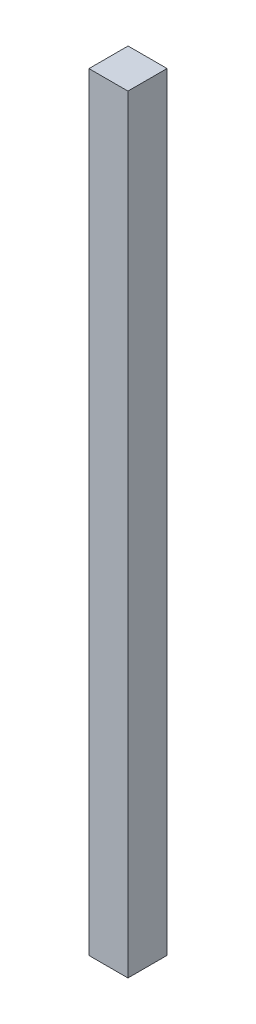
ISO-10303-21;
HEADER;
FILE_DESCRIPTION(('STEP AP214'),'2;1');
FILE_NAME('part.step','',(''),(''),'','','');
FILE_SCHEMA(('AUTOMOTIVE_DESIGN { 1 0 10303 214 1 1 1 1 }'));
ENDSEC;
DATA;
#1=APPLICATION_CONTEXT('core data for automotive mechanical design processes');
#2=APPLICATION_PROTOCOL_DEFINITION('international standard','automotive_design',2000,#1);
#3=PRODUCT_CONTEXT('',#1,'mechanical');
#4=PRODUCT('Part','Part','',(#3));
#5=PRODUCT_RELATED_PRODUCT_CATEGORY('part','',(#4));
#6=PRODUCT_DEFINITION_FORMATION('','',#4);
#7=PRODUCT_DEFINITION_CONTEXT('part definition',#1,'design');
#8=PRODUCT_DEFINITION('design','',#6,#7);
#9=PRODUCT_DEFINITION_SHAPE('','',#8);
#10=(LENGTH_UNIT() NAMED_UNIT(*) SI_UNIT(.MILLI.,.METRE.));
#11=(NAMED_UNIT(*) PLANE_ANGLE_UNIT() SI_UNIT($,.RADIAN.));
#12=(NAMED_UNIT(*) SI_UNIT($,.STERADIAN.) SOLID_ANGLE_UNIT());
#13=UNCERTAINTY_MEASURE_WITH_UNIT(LENGTH_MEASURE(1.E-05),#10,'distance_accuracy_value','');
#14=(GEOMETRIC_REPRESENTATION_CONTEXT(3) GLOBAL_UNCERTAINTY_ASSIGNED_CONTEXT((#13)) GLOBAL_UNIT_ASSIGNED_CONTEXT((#10,
#11,#12)) REPRESENTATION_CONTEXT('',''));
#15=CARTESIAN_POINT('',(0.,0.,0.));
#16=DIRECTION('',(0.,0.,1.));
#17=DIRECTION('',(1.,0.,0.));
#18=AXIS2_PLACEMENT_3D('',#15,#16,#17);
#19=CARTESIAN_POINT('',(-17.399,685.8,17.4625));
#20=DIRECTION('',(-1.,0.,0.));
#21=DIRECTION('',(0.,0.,1.));
#22=AXIS2_PLACEMENT_3D('',#19,#20,#21);
#23=PLANE('',#22);
#24=DIRECTION('',(0.,0.,-1.));
#25=VECTOR('',#24,1.);
#26=CARTESIAN_POINT('',(-17.399,0.,17.4625));
#27=LINE('',#26,#25);
#28=CARTESIAN_POINT('',(-17.399,0.,17.4625));
#29=VERTEX_POINT('',#28);
#30=CARTESIAN_POINT('',(-17.399,0.,-17.4625));
#31=VERTEX_POINT('',#30);
#32=EDGE_CURVE('E97',#29,#31,#27,.T.);
#33=ORIENTED_EDGE('',*,*,#32,.F.);
#34=DIRECTION('',(0.,-1.,0.));
#35=VECTOR('',#34,1.);
#36=CARTESIAN_POINT('',(-17.399,685.8,17.4625));
#37=LINE('',#36,#35);
#38=CARTESIAN_POINT('',(-17.399,685.8,17.4625));
#39=VERTEX_POINT('',#38);
#40=EDGE_CURVE('E11',#39,#29,#37,.T.);
#41=ORIENTED_EDGE('',*,*,#40,.F.);
#42=DIRECTION('',(0.,0.,-1.));
#43=VECTOR('',#42,1.);
#44=CARTESIAN_POINT('',(-17.399,685.8,17.4625));
#45=LINE('',#44,#43);
#46=CARTESIAN_POINT('',(-17.399,685.8,-17.4625));
#47=VERTEX_POINT('',#46);
#48=EDGE_CURVE('E92',#39,#47,#45,.T.);
#49=ORIENTED_EDGE('',*,*,#48,.T.);
#50=DIRECTION('',(0.,-1.,0.));
#51=VECTOR('',#50,1.);
#52=CARTESIAN_POINT('',(-17.399,685.8,-17.4625));
#53=LINE('',#52,#51);
#54=EDGE_CURVE('E35',#47,#31,#53,.T.);
#55=ORIENTED_EDGE('',*,*,#54,.T.);
#56=EDGE_LOOP('',(#33,#41,#49,#55));
#57=FACE_BOUND('',#56,.T.);
#58=ADVANCED_FACE('F32',(#57),#23,.T.);
#59=CARTESIAN_POINT('',(-17.399,685.8,17.4625));
#60=DIRECTION('',(0.,0.,-1.));
#61=DIRECTION('',(-1.,0.,0.));
#62=AXIS2_PLACEMENT_3D('',#59,#60,#61);
#63=PLANE('',#62);
#64=DIRECTION('',(1.,0.,0.));
#65=VECTOR('',#64,1.);
#66=CARTESIAN_POINT('',(-17.399,0.,17.4625));
#67=LINE('',#66,#65);
#68=CARTESIAN_POINT('',(17.399,0.,17.4625));
#69=VERTEX_POINT('',#68);
#70=EDGE_CURVE('E65',#29,#69,#67,.T.);
#71=ORIENTED_EDGE('',*,*,#70,.T.);
#72=DIRECTION('',(0.,-1.,0.));
#73=VECTOR('',#72,1.);
#74=CARTESIAN_POINT('',(17.399,685.8,17.4625));
#75=LINE('',#74,#73);
#76=CARTESIAN_POINT('',(17.399,685.8,17.4625));
#77=VERTEX_POINT('',#76);
#78=EDGE_CURVE('E41',#77,#69,#75,.T.);
#79=ORIENTED_EDGE('',*,*,#78,.F.);
#80=DIRECTION('',(1.,0.,0.));
#81=VECTOR('',#80,1.);
#82=CARTESIAN_POINT('',(-17.399,685.8,17.4625));
#83=LINE('',#82,#81);
#84=EDGE_CURVE('E82',#39,#77,#83,.T.);
#85=ORIENTED_EDGE('',*,*,#84,.F.);
#86=ORIENTED_EDGE('',*,*,#40,.T.);
#87=EDGE_LOOP('',(#71,#79,#85,#86));
#88=FACE_BOUND('',#87,.T.);
#89=ADVANCED_FACE('F107',(#88),#63,.F.);
#90=CARTESIAN_POINT('',(17.399,685.8,17.4625));
#91=DIRECTION('',(-1.,0.,0.));
#92=DIRECTION('',(0.,0.,1.));
#93=AXIS2_PLACEMENT_3D('',#90,#91,#92);
#94=PLANE('',#93);
#95=DIRECTION('',(0.,0.,-1.));
#96=VECTOR('',#95,1.);
#97=CARTESIAN_POINT('',(17.399,0.,17.4625));
#98=LINE('',#97,#96);
#99=CARTESIAN_POINT('',(17.399,0.,-17.4625));
#100=VERTEX_POINT('',#99);
#101=EDGE_CURVE('E89',#69,#100,#98,.T.);
#102=ORIENTED_EDGE('',*,*,#101,.T.);
#103=DIRECTION('',(0.,-1.,0.));
#104=VECTOR('',#103,1.);
#105=CARTESIAN_POINT('',(17.399,685.8,-17.4625));
#106=LINE('',#105,#104);
#107=CARTESIAN_POINT('',(17.399,685.8,-17.4625));
#108=VERTEX_POINT('',#107);
#109=EDGE_CURVE('E86',#108,#100,#106,.T.);
#110=ORIENTED_EDGE('',*,*,#109,.F.);
#111=DIRECTION('',(0.,0.,-1.));
#112=VECTOR('',#111,1.);
#113=CARTESIAN_POINT('',(17.399,685.8,17.4625));
#114=LINE('',#113,#112);
#115=EDGE_CURVE('E77',#77,#108,#114,.T.);
#116=ORIENTED_EDGE('',*,*,#115,.F.);
#117=ORIENTED_EDGE('',*,*,#78,.T.);
#118=EDGE_LOOP('',(#102,#110,#116,#117));
#119=FACE_BOUND('',#118,.T.);
#120=ADVANCED_FACE('F87',(#119),#94,.F.);
#121=CARTESIAN_POINT('',(-17.399,685.8,-17.4625));
#122=DIRECTION('',(0.,0.,-1.));
#123=DIRECTION('',(-1.,0.,0.));
#124=AXIS2_PLACEMENT_3D('',#121,#122,#123);
#125=PLANE('',#124);
#126=DIRECTION('',(1.,0.,0.));
#127=VECTOR('',#126,1.);
#128=CARTESIAN_POINT('',(-17.399,0.,-17.4625));
#129=LINE('',#128,#127);
#130=EDGE_CURVE('E100',#31,#100,#129,.T.);
#131=ORIENTED_EDGE('',*,*,#130,.F.);
#132=ORIENTED_EDGE('',*,*,#54,.F.);
#133=DIRECTION('',(1.,0.,0.));
#134=VECTOR('',#133,1.);
#135=CARTESIAN_POINT('',(-17.399,685.8,-17.4625));
#136=LINE('',#135,#134);
#137=EDGE_CURVE('E81',#47,#108,#136,.T.);
#138=ORIENTED_EDGE('',*,*,#137,.T.);
#139=ORIENTED_EDGE('',*,*,#109,.T.);
#140=EDGE_LOOP('',(#131,#132,#138,#139));
#141=FACE_BOUND('',#140,.T.);
#142=ADVANCED_FACE('F91',(#141),#125,.T.);
#143=CARTESIAN_POINT('',(0.,685.8,0.));
#144=DIRECTION('',(0.,-1.,0.));
#145=DIRECTION('',(0.,0.,-1.));
#146=AXIS2_PLACEMENT_3D('',#143,#144,#145);
#147=PLANE('',#146);
#148=ORIENTED_EDGE('',*,*,#48,.F.);
#149=ORIENTED_EDGE('',*,*,#84,.T.);
#150=ORIENTED_EDGE('',*,*,#115,.T.);
#151=ORIENTED_EDGE('',*,*,#137,.F.);
#152=EDGE_LOOP('',(#148,#149,#150,#151));
#153=FACE_BOUND('',#152,.T.);
#154=ADVANCED_FACE('F80',(#153),#147,.F.);
#155=CARTESIAN_POINT('',(0.,0.,0.));
#156=DIRECTION('',(0.,-1.,0.));
#157=DIRECTION('',(0.,0.,-1.));
#158=AXIS2_PLACEMENT_3D('',#155,#156,#157);
#159=PLANE('',#158);
#160=ORIENTED_EDGE('',*,*,#32,.T.);
#161=ORIENTED_EDGE('',*,*,#130,.T.);
#162=ORIENTED_EDGE('',*,*,#101,.F.);
#163=ORIENTED_EDGE('',*,*,#70,.F.);
#164=EDGE_LOOP('',(#160,#161,#162,#163));
#165=FACE_BOUND('',#164,.T.);
#166=ADVANCED_FACE('F105',(#165),#159,.T.);
#167=CLOSED_SHELL('',(#58,#89,#120,#142,#154,#166));
#168=MANIFOLD_SOLID_BREP('B2',#167);
#169=ADVANCED_BREP_SHAPE_REPRESENTATION('',(#18,#168),#14);
#170=SHAPE_DEFINITION_REPRESENTATION(#9,#169);
ENDSEC;
END-ISO-10303-21;
